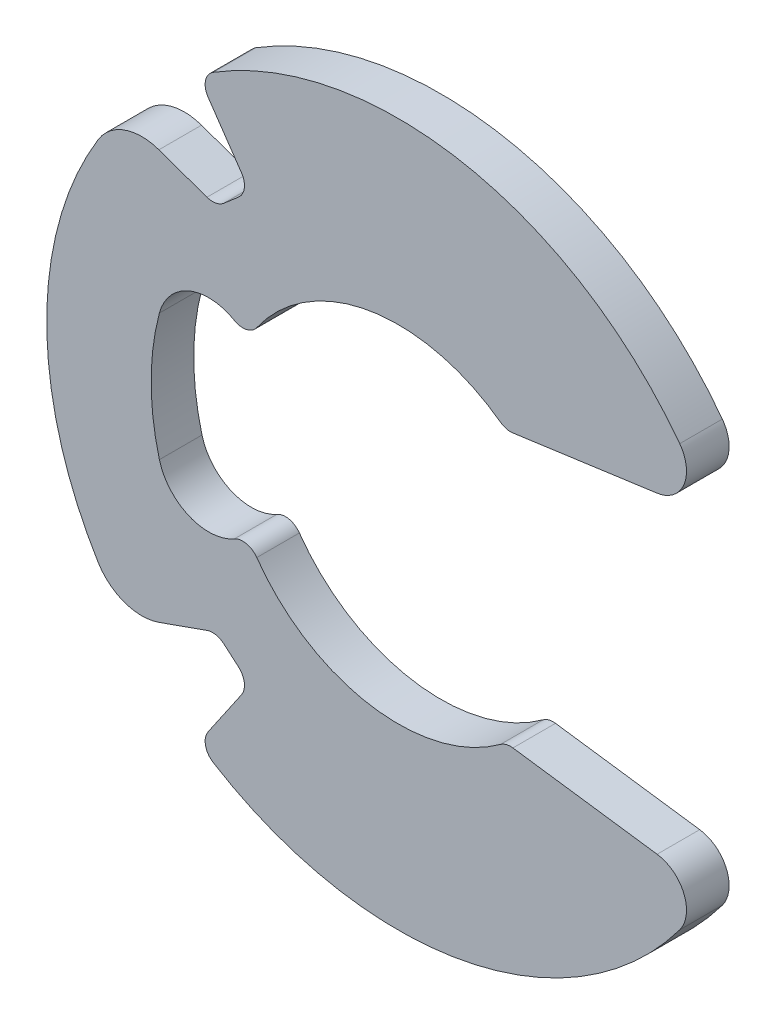
ISO-10303-21;
HEADER;
FILE_DESCRIPTION(('STEP AP214'),'2;1');
FILE_NAME('part.step','',(''),(''),'','','');
FILE_SCHEMA(('AUTOMOTIVE_DESIGN { 1 0 10303 214 1 1 1 1 }'));
ENDSEC;
DATA;
#1=APPLICATION_CONTEXT('core data for automotive mechanical design processes');
#2=APPLICATION_PROTOCOL_DEFINITION('international standard','automotive_design',2000,#1);
#3=PRODUCT_CONTEXT('',#1,'mechanical');
#4=PRODUCT('Part','Part','',(#3));
#5=PRODUCT_RELATED_PRODUCT_CATEGORY('part','',(#4));
#6=PRODUCT_DEFINITION_FORMATION('','',#4);
#7=PRODUCT_DEFINITION_CONTEXT('part definition',#1,'design');
#8=PRODUCT_DEFINITION('design','',#6,#7);
#9=PRODUCT_DEFINITION_SHAPE('','',#8);
#10=(LENGTH_UNIT() NAMED_UNIT(*) SI_UNIT(.MILLI.,.METRE.));
#11=(NAMED_UNIT(*) PLANE_ANGLE_UNIT() SI_UNIT($,.RADIAN.));
#12=(NAMED_UNIT(*) SI_UNIT($,.STERADIAN.) SOLID_ANGLE_UNIT());
#13=UNCERTAINTY_MEASURE_WITH_UNIT(LENGTH_MEASURE(1.E-05),#10,'distance_accuracy_value','');
#14=(GEOMETRIC_REPRESENTATION_CONTEXT(3) GLOBAL_UNCERTAINTY_ASSIGNED_CONTEXT((#13)) GLOBAL_UNIT_ASSIGNED_CONTEXT((#10,
#11,#12)) REPRESENTATION_CONTEXT('',''));
#15=CARTESIAN_POINT('',(0.,0.,0.));
#16=DIRECTION('',(0.,0.,1.));
#17=DIRECTION('',(1.,0.,0.));
#18=AXIS2_PLACEMENT_3D('',#15,#16,#17);
#19=CARTESIAN_POINT('',(0.,0.,0.));
#20=DIRECTION('',(0.,0.,-1.));
#21=DIRECTION('',(-1.,0.,0.));
#22=AXIS2_PLACEMENT_3D('',#19,#20,#21);
#23=PLANE('',#22);
#24=CARTESIAN_POINT('',(0.,0.,0.));
#25=DIRECTION('',(0.,0.,-1.));
#26=DIRECTION('',(-1.,0.,0.));
#27=AXIS2_PLACEMENT_3D('',#24,#25,#26);
#28=CIRCLE('',#27,5.1562);
#29=CARTESIAN_POINT('',(-4.21618561440545,-2.96819428354689,0.));
#30=VERTEX_POINT('',#29);
#31=CARTESIAN_POINT('',(3.04826151729699,-4.15866567088125,0.));
#32=VERTEX_POINT('',#31);
#33=EDGE_CURVE('E339',#30,#32,#28,.F.);
#34=ORIENTED_EDGE('',*,*,#33,.T.);
#35=CARTESIAN_POINT('',(3.34858284905039,-4.5683864266331,0.));
#36=DIRECTION('',(0.,0.,-1.));
#37=DIRECTION('',(-1.,0.,0.));
#38=AXIS2_PLACEMENT_3D('',#35,#36,#37);
#39=CIRCLE('',#38,0.508);
#40=CARTESIAN_POINT('',(3.41825205926127,-4.06518646523744,0.));
#41=VERTEX_POINT('',#40);
#42=EDGE_CURVE('E336',#41,#32,#39,.F.);
#43=ORIENTED_EDGE('',*,*,#42,.F.);
#44=DIRECTION('',(0.990551105109562,-0.137144114588364,0.));
#45=VECTOR('',#44,1.);
#46=CARTESIAN_POINT('',(0.,-3.59192148204873,0.));
#47=LINE('',#46,#45);
#48=CARTESIAN_POINT('',(7.71621548730133,-4.66024954258016,0.));
#49=VERTEX_POINT('',#48);
#50=EDGE_CURVE('E235',#41,#49,#47,.T.);
#51=ORIENTED_EDGE('',*,*,#50,.T.);
#52=CARTESIAN_POINT('',(7.57687706687955,-5.66664946537147,0.));
#53=DIRECTION('',(0.,0.,-1.));
#54=DIRECTION('',(-1.,0.,0.));
#55=AXIS2_PLACEMENT_3D('',#52,#53,#54);
#56=CIRCLE('',#55,1.016);
#57=CARTESIAN_POINT('',(8.39050144990017,-6.27514873682076,0.));
#58=VERTEX_POINT('',#57);
#59=EDGE_CURVE('E238',#58,#49,#56,.F.);
#60=ORIENTED_EDGE('',*,*,#59,.F.);
#61=CARTESIAN_POINT('',(0.,0.,0.));
#62=DIRECTION('',(0.,0.,-1.));
#63=DIRECTION('',(-1.,0.,0.));
#64=AXIS2_PLACEMENT_3D('',#61,#62,#63);
#65=CIRCLE('',#64,10.4775);
#66=CARTESIAN_POINT('',(-5.51465485817055,-8.90879273780998,0.));
#67=VERTEX_POINT('',#66);
#68=EDGE_CURVE('E215',#67,#58,#65,.F.);
#69=ORIENTED_EDGE('',*,*,#68,.F.);
#70=CARTESIAN_POINT('',(-5.24727765292592,-8.47685127173434,0.));
#71=DIRECTION('',(0.,0.,-1.));
#72=DIRECTION('',(-1.,0.,0.));
#73=AXIS2_PLACEMENT_3D('',#70,#71,#72);
#74=CIRCLE('',#73,0.508);
#75=CARTESIAN_POINT('',(-5.6664647231543,-8.18989099547062,0.));
#76=VERTEX_POINT('',#75);
#77=EDGE_CURVE('E20',#76,#67,#74,.F.);
#78=ORIENTED_EDGE('',*,*,#77,.F.);
#79=DIRECTION('',(0.56488243359,0.825171398087354,0.));
#80=VECTOR('',#79,1.);
#81=CARTESIAN_POINT('',(-7.96096866359448,-11.541666359447,0.));
#82=LINE('',#81,#80);
#83=CARTESIAN_POINT('',(-4.67174469224146,-6.73681957776461,0.));
#84=VERTEX_POINT('',#83);
#85=EDGE_CURVE('E212',#76,#84,#82,.T.);
#86=ORIENTED_EDGE('',*,*,#85,.T.);
#87=CARTESIAN_POINT('',(-5.09093176246983,-6.4498593015009,0.));
#88=DIRECTION('',(0.,0.,-1.));
#89=DIRECTION('',(-1.,0.,0.));
#90=AXIS2_PLACEMENT_3D('',#87,#88,#89);
#91=CIRCLE('',#90,0.508);
#92=CARTESIAN_POINT('',(-4.75923843445855,-6.0650950410078,0.));
#93=VERTEX_POINT('',#92);
#94=EDGE_CURVE('E387',#84,#93,#91,.F.);
#95=ORIENTED_EDGE('',*,*,#94,.T.);
#96=DIRECTION('',(-0.757409961600578,0.652939622069462,0.));
#97=VECTOR('',#96,1.);
#98=CARTESIAN_POINT('',(-4.41503502304148,-6.36182211981562,0.));
#99=LINE('',#98,#97);
#100=CARTESIAN_POINT('',(-5.19974545035899,-5.68534761350743,0.));
#101=VERTEX_POINT('',#100);
#102=EDGE_CURVE('E262',#93,#101,#99,.T.);
#103=ORIENTED_EDGE('',*,*,#102,.T.);
#104=CARTESIAN_POINT('',(-5.53143877837027,-6.07011187400052,0.));
#105=DIRECTION('',(0.,0.,-1.));
#106=DIRECTION('',(-1.,0.,0.));
#107=AXIS2_PLACEMENT_3D('',#104,#105,#106);
#108=CIRCLE('',#107,0.508);
#109=CARTESIAN_POINT('',(-5.70123922502142,-5.59133028672186,0.));
#110=VERTEX_POINT('',#109);
#111=EDGE_CURVE('E386',#101,#110,#108,.F.);
#112=ORIENTED_EDGE('',*,*,#111,.T.);
#113=DIRECTION('',(-0.942483439524914,-0.334252847738487,0.));
#114=VECTOR('',#113,1.);
#115=CARTESIAN_POINT('',(-5.42319262672811,-5.49272073732714,0.));
#116=LINE('',#115,#114);
#117=CARTESIAN_POINT('',(-7.13394241485243,-6.09944013892937,0.));
#118=VERTEX_POINT('',#117);
#119=EDGE_CURVE('E257',#110,#118,#116,.T.);
#120=ORIENTED_EDGE('',*,*,#119,.T.);
#121=CARTESIAN_POINT('',(-7.64334375480588,-4.6630953770934,0.));
#122=DIRECTION('',(0.,0.,-1.));
#123=DIRECTION('',(-1.,0.,0.));
#124=AXIS2_PLACEMENT_3D('',#121,#122,#123);
#125=CIRCLE('',#124,1.524);
#126=CARTESIAN_POINT('',(-8.94433843647497,-5.45681373915185,0.));
#127=VERTEX_POINT('',#126);
#128=EDGE_CURVE('E260',#127,#118,#125,.F.);
#129=ORIENTED_EDGE('',*,*,#128,.F.);
#130=CARTESIAN_POINT('',(0.,0.,0.));
#131=DIRECTION('',(0.,0.,-1.));
#132=DIRECTION('',(-1.,0.,0.));
#133=AXIS2_PLACEMENT_3D('',#130,#131,#132);
#134=CIRCLE('',#133,10.4775);
#135=CARTESIAN_POINT('',(-8.94433843647498,5.45681373915185,0.));
#136=VERTEX_POINT('',#135);
#137=EDGE_CURVE('E381',#136,#127,#134,.F.);
#138=ORIENTED_EDGE('',*,*,#137,.F.);
#139=CARTESIAN_POINT('',(-7.64334375480589,4.6630953770934,0.));
#140=DIRECTION('',(0.,0.,-1.));
#141=DIRECTION('',(-1.,0.,0.));
#142=AXIS2_PLACEMENT_3D('',#139,#140,#141);
#143=CIRCLE('',#142,1.524);
#144=CARTESIAN_POINT('',(-7.13394241485244,6.09944013892937,0.));
#145=VERTEX_POINT('',#144);
#146=EDGE_CURVE('E379',#145,#136,#143,.F.);
#147=ORIENTED_EDGE('',*,*,#146,.F.);
#148=DIRECTION('',(-0.942483439524914,0.334252847738487,0.));
#149=VECTOR('',#148,1.);
#150=CARTESIAN_POINT('',(-5.42319262672811,5.49272073732714,0.));
#151=LINE('',#150,#149);
#152=CARTESIAN_POINT('',(-5.70123922502142,5.59133028672186,0.));
#153=VERTEX_POINT('',#152);
#154=EDGE_CURVE('E253',#153,#145,#151,.T.);
#155=ORIENTED_EDGE('',*,*,#154,.F.);
#156=CARTESIAN_POINT('',(-5.53143877837027,6.07011187400052,0.));
#157=DIRECTION('',(0.,0.,-1.));
#158=DIRECTION('',(-1.,0.,0.));
#159=AXIS2_PLACEMENT_3D('',#156,#157,#158);
#160=CIRCLE('',#159,0.508);
#161=CARTESIAN_POINT('',(-5.19974545035898,5.68534761350743,0.));
#162=VERTEX_POINT('',#161);
#163=EDGE_CURVE('E252',#153,#162,#160,.F.);
#164=ORIENTED_EDGE('',*,*,#163,.T.);
#165=DIRECTION('',(-0.757409961600578,-0.652939622069462,0.));
#166=VECTOR('',#165,1.);
#167=CARTESIAN_POINT('',(-4.41503502304148,6.36182211981562,0.));
#168=LINE('',#167,#166);
#169=CARTESIAN_POINT('',(-4.75923843445855,6.0650950410078,0.));
#170=VERTEX_POINT('',#169);
#171=EDGE_CURVE('E249',#170,#162,#168,.T.);
#172=ORIENTED_EDGE('',*,*,#171,.F.);
#173=CARTESIAN_POINT('',(-5.09093176246983,6.4498593015009,0.));
#174=DIRECTION('',(0.,0.,-1.));
#175=DIRECTION('',(-1.,0.,0.));
#176=AXIS2_PLACEMENT_3D('',#173,#174,#175);
#177=CIRCLE('',#176,0.508);
#178=CARTESIAN_POINT('',(-4.67174469224146,6.73681957776462,0.));
#179=VERTEX_POINT('',#178);
#180=EDGE_CURVE('E248',#170,#179,#177,.F.);
#181=ORIENTED_EDGE('',*,*,#180,.T.);
#182=DIRECTION('',(0.564882433590001,-0.825171398087354,0.));
#183=VECTOR('',#182,1.);
#184=CARTESIAN_POINT('',(-7.96096866359448,11.541666359447,0.));
#185=LINE('',#184,#183);
#186=CARTESIAN_POINT('',(-5.6664647231543,8.18989099547063,0.));
#187=VERTEX_POINT('',#186);
#188=EDGE_CURVE('E245',#187,#179,#185,.T.);
#189=ORIENTED_EDGE('',*,*,#188,.F.);
#190=CARTESIAN_POINT('',(-5.24727765292593,8.47685127173435,0.));
#191=DIRECTION('',(0.,0.,-1.));
#192=DIRECTION('',(-1.,0.,0.));
#193=AXIS2_PLACEMENT_3D('',#190,#191,#192);
#194=CIRCLE('',#193,0.508);
#195=CARTESIAN_POINT('',(-5.51465485817056,8.90879273780999,0.));
#196=VERTEX_POINT('',#195);
#197=EDGE_CURVE('E370',#196,#187,#194,.F.);
#198=ORIENTED_EDGE('',*,*,#197,.F.);
#199=CARTESIAN_POINT('',(0.,0.,0.));
#200=DIRECTION('',(0.,0.,-1.));
#201=DIRECTION('',(-1.,0.,0.));
#202=AXIS2_PLACEMENT_3D('',#199,#200,#201);
#203=CIRCLE('',#202,10.4775);
#204=CARTESIAN_POINT('',(8.39050144990018,6.27514873682076,0.));
#205=VERTEX_POINT('',#204);
#206=EDGE_CURVE('E368',#205,#196,#203,.F.);
#207=ORIENTED_EDGE('',*,*,#206,.F.);
#208=CARTESIAN_POINT('',(7.57687706687956,5.66664946537147,0.));
#209=DIRECTION('',(0.,0.,-1.));
#210=DIRECTION('',(-1.,0.,0.));
#211=AXIS2_PLACEMENT_3D('',#208,#209,#210);
#212=CIRCLE('',#211,1.016);
#213=CARTESIAN_POINT('',(7.71621548730134,4.66024954258016,0.));
#214=VERTEX_POINT('',#213);
#215=EDGE_CURVE('E364',#214,#205,#212,.F.);
#216=ORIENTED_EDGE('',*,*,#215,.F.);
#217=DIRECTION('',(-0.990551105109562,-0.137144114588364,0.));
#218=VECTOR('',#217,1.);
#219=CARTESIAN_POINT('',(11.2983179723503,5.15619999999999,0.));
#220=LINE('',#219,#218);
#221=CARTESIAN_POINT('',(3.41825205926129,4.06518646523745,0.));
#222=VERTEX_POINT('',#221);
#223=EDGE_CURVE('E240',#214,#222,#220,.T.);
#224=ORIENTED_EDGE('',*,*,#223,.T.);
#225=CARTESIAN_POINT('',(3.3485828490504,4.5683864266331,0.));
#226=DIRECTION('',(0.,0.,-1.));
#227=DIRECTION('',(-1.,0.,0.));
#228=AXIS2_PLACEMENT_3D('',#225,#226,#227);
#229=CIRCLE('',#228,0.508);
#230=CARTESIAN_POINT('',(3.048261517297,4.15866567088126,0.));
#231=VERTEX_POINT('',#230);
#232=EDGE_CURVE('E243',#231,#222,#229,.F.);
#233=ORIENTED_EDGE('',*,*,#232,.F.);
#234=CARTESIAN_POINT('',(0.,0.,0.));
#235=DIRECTION('',(0.,0.,-1.));
#236=DIRECTION('',(-1.,0.,0.));
#237=AXIS2_PLACEMENT_3D('',#234,#235,#236);
#238=CIRCLE('',#237,5.1562);
#239=CARTESIAN_POINT('',(-4.21618561440546,2.96819428354689,0.));
#240=VERTEX_POINT('',#239);
#241=EDGE_CURVE('E358',#231,#240,#238,.F.);
#242=ORIENTED_EDGE('',*,*,#241,.T.);
#243=CARTESIAN_POINT('',(-4.63157335966708,3.26062721788649,0.));
#244=DIRECTION('',(0.,0.,1.));
#245=DIRECTION('',(1.,0.,0.));
#246=AXIS2_PLACEMENT_3D('',#243,#244,#245);
#247=CIRCLE('',#246,0.508);
#248=CARTESIAN_POINT('',(-4.88521418696268,2.82047913970279,0.));
#249=VERTEX_POINT('',#248);
#250=EDGE_CURVE('E355',#249,#240,#247,.T.);
#251=ORIENTED_EDGE('',*,*,#250,.F.);
#252=CARTESIAN_POINT('',(-5.64613666884947,1.50003490515168,0.));
#253=DIRECTION('',(0.,0.,1.));
#254=DIRECTION('',(1.,0.,0.));
#255=AXIS2_PLACEMENT_3D('',#252,#253,#254);
#256=CIRCLE('',#255,1.524);
#257=CARTESIAN_POINT('',(-7.1190418868102,1.89134835866951,0.));
#258=VERTEX_POINT('',#257);
#259=EDGE_CURVE('E352',#249,#258,#256,.T.);
#260=ORIENTED_EDGE('',*,*,#259,.T.);
#261=CARTESIAN_POINT('',(0.,0.,0.));
#262=DIRECTION('',(0.,0.,1.));
#263=DIRECTION('',(1.,0.,0.));
#264=AXIS2_PLACEMENT_3D('',#261,#262,#263);
#265=CIRCLE('',#264,7.366);
#266=CARTESIAN_POINT('',(-7.11904188681019,-1.89134835866951,0.));
#267=VERTEX_POINT('',#266);
#268=EDGE_CURVE('E349',#258,#267,#265,.T.);
#269=ORIENTED_EDGE('',*,*,#268,.T.);
#270=CARTESIAN_POINT('',(-5.64613666884946,-1.50003490515168,0.));
#271=DIRECTION('',(0.,0.,1.));
#272=DIRECTION('',(1.,0.,0.));
#273=AXIS2_PLACEMENT_3D('',#270,#271,#272);
#274=CIRCLE('',#273,1.524);
#275=CARTESIAN_POINT('',(-4.88521418696267,-2.82047913970278,0.));
#276=VERTEX_POINT('',#275);
#277=EDGE_CURVE('E345',#267,#276,#274,.T.);
#278=ORIENTED_EDGE('',*,*,#277,.T.);
#279=CARTESIAN_POINT('',(-4.63157335966708,-3.26062721788648,0.));
#280=DIRECTION('',(0.,0.,-1.));
#281=DIRECTION('',(-1.,0.,0.));
#282=AXIS2_PLACEMENT_3D('',#279,#280,#281);
#283=CIRCLE('',#282,0.508);
#284=EDGE_CURVE('E342',#30,#276,#283,.F.);
#285=ORIENTED_EDGE('',*,*,#284,.F.);
#286=EDGE_LOOP('',(#34,#43,#51,#60,#69,#78,#86,#95,#103,#112,#120,#129,#138,#147,#155,#164,#172,
#181,#189,#198,#207,#216,#224,#233,#242,#251,#260,#269,#278,#285));
#287=FACE_BOUND('',#286,.T.);
#288=ADVANCED_FACE('F17',(#287),#23,.T.);
#289=CARTESIAN_POINT('',(-5.24727765292592,-8.47685127173434,1.27));
#290=DIRECTION('',(0.,0.,-1.));
#291=DIRECTION('',(-1.,0.,0.));
#292=AXIS2_PLACEMENT_3D('',#289,#290,#291);
#293=CYLINDRICAL_SURFACE('',#292,0.508);
#294=DIRECTION('',(0.,0.,1.));
#295=VECTOR('',#294,1.);
#296=CARTESIAN_POINT('',(-5.6664647231543,-8.18989099547062,-28.9619533727259));
#297=LINE('',#296,#295);
#298=CARTESIAN_POINT('',(-5.66646472315429,-8.18989099547062,1.27));
#299=VERTEX_POINT('',#298);
#300=EDGE_CURVE('E220',#299,#76,#297,.F.);
#301=ORIENTED_EDGE('',*,*,#300,.T.);
#302=ORIENTED_EDGE('',*,*,#77,.T.);
#303=DIRECTION('',(0.,0.,-1.));
#304=VECTOR('',#303,1.);
#305=CARTESIAN_POINT('',(-5.51465485817055,-8.90879273780998,1.27));
#306=LINE('',#305,#304);
#307=CARTESIAN_POINT('',(-5.51465485817055,-8.90879273780998,1.27));
#308=VERTEX_POINT('',#307);
#309=EDGE_CURVE('E332',#308,#67,#306,.T.);
#310=ORIENTED_EDGE('',*,*,#309,.F.);
#311=CARTESIAN_POINT('',(-5.24727765292592,-8.47685127173434,1.27));
#312=DIRECTION('',(0.,0.,-1.));
#313=DIRECTION('',(-1.,0.,0.));
#314=AXIS2_PLACEMENT_3D('',#311,#312,#313);
#315=CIRCLE('',#314,0.508);
#316=EDGE_CURVE('E230',#308,#299,#315,.T.);
#317=ORIENTED_EDGE('',*,*,#316,.T.);
#318=EDGE_LOOP('',(#301,#302,#310,#317));
#319=FACE_BOUND('',#318,.T.);
#320=ADVANCED_FACE('F229',(#319),#293,.T.);
#321=CARTESIAN_POINT('',(-7.96096866359448,-11.541666359447,-28.9619533727259));
#322=DIRECTION('',(0.825171398087354,-0.56488243359,0.));
#323=DIRECTION('',(0.56488243359,0.825171398087354,0.));
#324=AXIS2_PLACEMENT_3D('',#321,#322,#323);
#325=PLANE('',#324);
#326=ORIENTED_EDGE('',*,*,#300,.F.);
#327=DIRECTION('',(0.56488243359,0.825171398087354,0.));
#328=VECTOR('',#327,1.);
#329=CARTESIAN_POINT('',(-5.66646472315429,-8.18989099547062,1.27));
#330=LINE('',#329,#328);
#331=CARTESIAN_POINT('',(-4.67174469224146,-6.73681957776462,1.27));
#332=VERTEX_POINT('',#331);
#333=EDGE_CURVE('E330',#299,#332,#330,.T.);
#334=ORIENTED_EDGE('',*,*,#333,.T.);
#335=DIRECTION('',(0.,0.,-1.));
#336=VECTOR('',#335,1.);
#337=CARTESIAN_POINT('',(-4.67174469224146,-6.73681957776461,-28.9619533727259));
#338=LINE('',#337,#336);
#339=EDGE_CURVE('E227',#332,#84,#338,.T.);
#340=ORIENTED_EDGE('',*,*,#339,.T.);
#341=ORIENTED_EDGE('',*,*,#85,.F.);
#342=EDGE_LOOP('',(#326,#334,#340,#341));
#343=FACE_BOUND('',#342,.T.);
#344=ADVANCED_FACE('F224',(#343),#325,.F.);
#345=CARTESIAN_POINT('',(-5.09093176246983,-6.4498593015009,-28.9619533727259));
#346=DIRECTION('',(0.,0.,-1.));
#347=DIRECTION('',(-1.,0.,0.));
#348=AXIS2_PLACEMENT_3D('',#345,#346,#347);
#349=CYLINDRICAL_SURFACE('',#348,0.508);
#350=ORIENTED_EDGE('',*,*,#339,.F.);
#351=CARTESIAN_POINT('',(-5.09093176246983,-6.4498593015009,1.27));
#352=DIRECTION('',(0.,0.,-1.));
#353=DIRECTION('',(-1.,0.,0.));
#354=AXIS2_PLACEMENT_3D('',#351,#352,#353);
#355=CIRCLE('',#354,0.508);
#356=CARTESIAN_POINT('',(-4.75923843445855,-6.0650950410078,1.27));
#357=VERTEX_POINT('',#356);
#358=EDGE_CURVE('E327',#332,#357,#355,.F.);
#359=ORIENTED_EDGE('',*,*,#358,.T.);
#360=DIRECTION('',(0.,0.,1.));
#361=VECTOR('',#360,1.);
#362=CARTESIAN_POINT('',(-4.75923843445855,-6.0650950410078,-28.9619533727259));
#363=LINE('',#362,#361);
#364=EDGE_CURVE('E264',#357,#93,#363,.F.);
#365=ORIENTED_EDGE('',*,*,#364,.T.);
#366=ORIENTED_EDGE('',*,*,#94,.F.);
#367=EDGE_LOOP('',(#350,#359,#365,#366));
#368=FACE_BOUND('',#367,.T.);
#369=ADVANCED_FACE('F554',(#368),#349,.F.);
#370=CARTESIAN_POINT('',(-4.41503502304148,-6.36182211981562,-28.9619533727259));
#371=DIRECTION('',(0.652939622069462,0.757409961600578,0.));
#372=DIRECTION('',(-0.757409961600578,0.652939622069462,0.));
#373=AXIS2_PLACEMENT_3D('',#370,#371,#372);
#374=PLANE('',#373);
#375=ORIENTED_EDGE('',*,*,#364,.F.);
#376=DIRECTION('',(-0.757409961600577,0.652939622069462,0.));
#377=VECTOR('',#376,1.);
#378=CARTESIAN_POINT('',(-4.75923843445855,-6.0650950410078,1.27));
#379=LINE('',#378,#377);
#380=CARTESIAN_POINT('',(-5.19974545035899,-5.68534761350743,1.27));
#381=VERTEX_POINT('',#380);
#382=EDGE_CURVE('E326',#357,#381,#379,.T.);
#383=ORIENTED_EDGE('',*,*,#382,.T.);
#384=DIRECTION('',(0.,0.,-1.));
#385=VECTOR('',#384,1.);
#386=CARTESIAN_POINT('',(-5.19974545035899,-5.68534761350743,-28.9619533727259));
#387=LINE('',#386,#385);
#388=EDGE_CURVE('E263',#381,#101,#387,.T.);
#389=ORIENTED_EDGE('',*,*,#388,.T.);
#390=ORIENTED_EDGE('',*,*,#102,.F.);
#391=EDGE_LOOP('',(#375,#383,#389,#390));
#392=FACE_BOUND('',#391,.T.);
#393=ADVANCED_FACE('F552',(#392),#374,.F.);
#394=CARTESIAN_POINT('',(-5.53143877837027,-6.07011187400052,-28.9619533727259));
#395=DIRECTION('',(0.,0.,-1.));
#396=DIRECTION('',(-1.,0.,0.));
#397=AXIS2_PLACEMENT_3D('',#394,#395,#396);
#398=CYLINDRICAL_SURFACE('',#397,0.508);
#399=ORIENTED_EDGE('',*,*,#388,.F.);
#400=CARTESIAN_POINT('',(-5.53143877837027,-6.07011187400052,1.27));
#401=DIRECTION('',(0.,0.,-1.));
#402=DIRECTION('',(-1.,0.,0.));
#403=AXIS2_PLACEMENT_3D('',#400,#401,#402);
#404=CIRCLE('',#403,0.508);
#405=CARTESIAN_POINT('',(-5.70123922502142,-5.59133028672186,1.27));
#406=VERTEX_POINT('',#405);
#407=EDGE_CURVE('E323',#381,#406,#404,.F.);
#408=ORIENTED_EDGE('',*,*,#407,.T.);
#409=DIRECTION('',(0.,0.,1.));
#410=VECTOR('',#409,1.);
#411=CARTESIAN_POINT('',(-5.70123922502142,-5.59133028672186,-28.9619533727259));
#412=LINE('',#411,#410);
#413=EDGE_CURVE('E261',#406,#110,#412,.F.);
#414=ORIENTED_EDGE('',*,*,#413,.T.);
#415=ORIENTED_EDGE('',*,*,#111,.F.);
#416=EDGE_LOOP('',(#399,#408,#414,#415));
#417=FACE_BOUND('',#416,.T.);
#418=ADVANCED_FACE('F549',(#417),#398,.F.);
#419=CARTESIAN_POINT('',(-5.42319262672811,-5.49272073732714,-28.9619533727259));
#420=DIRECTION('',(-0.334252847738487,0.942483439524914,0.));
#421=DIRECTION('',(-0.942483439524914,-0.334252847738487,0.));
#422=AXIS2_PLACEMENT_3D('',#419,#420,#421);
#423=PLANE('',#422);
#424=ORIENTED_EDGE('',*,*,#413,.F.);
#425=DIRECTION('',(-0.942483439524914,-0.334252847738487,0.));
#426=VECTOR('',#425,1.);
#427=CARTESIAN_POINT('',(-5.70123922502142,-5.59133028672186,1.27));
#428=LINE('',#427,#426);
#429=CARTESIAN_POINT('',(-7.13394241485243,-6.09944013892937,1.27));
#430=VERTEX_POINT('',#429);
#431=EDGE_CURVE('E322',#406,#430,#428,.T.);
#432=ORIENTED_EDGE('',*,*,#431,.T.);
#433=DIRECTION('',(0.,0.,-1.));
#434=VECTOR('',#433,1.);
#435=CARTESIAN_POINT('',(-7.13394241485242,-6.09944013892937,1.27));
#436=LINE('',#435,#434);
#437=EDGE_CURVE('E385',#118,#430,#436,.F.);
#438=ORIENTED_EDGE('',*,*,#437,.F.);
#439=ORIENTED_EDGE('',*,*,#119,.F.);
#440=EDGE_LOOP('',(#424,#432,#438,#439));
#441=FACE_BOUND('',#440,.T.);
#442=ADVANCED_FACE('F545',(#441),#423,.F.);
#443=CARTESIAN_POINT('',(-7.64334375480588,-4.6630953770934,1.27));
#444=DIRECTION('',(0.,0.,-1.));
#445=DIRECTION('',(-1.,0.,0.));
#446=AXIS2_PLACEMENT_3D('',#443,#444,#445);
#447=CYLINDRICAL_SURFACE('',#446,1.524);
#448=ORIENTED_EDGE('',*,*,#128,.T.);
#449=ORIENTED_EDGE('',*,*,#437,.T.);
#450=CARTESIAN_POINT('',(-7.64334375480588,-4.6630953770934,1.27));
#451=DIRECTION('',(0.,0.,-1.));
#452=DIRECTION('',(-1.,0.,0.));
#453=AXIS2_PLACEMENT_3D('',#450,#451,#452);
#454=CIRCLE('',#453,1.524);
#455=CARTESIAN_POINT('',(-8.94433843647497,-5.45681373915185,1.27));
#456=VERTEX_POINT('',#455);
#457=EDGE_CURVE('E319',#430,#456,#454,.T.);
#458=ORIENTED_EDGE('',*,*,#457,.T.);
#459=DIRECTION('',(0.,0.,-1.));
#460=VECTOR('',#459,1.);
#461=CARTESIAN_POINT('',(-8.94433843647497,-5.45681373915185,1.27));
#462=LINE('',#461,#460);
#463=EDGE_CURVE('E383',#127,#456,#462,.F.);
#464=ORIENTED_EDGE('',*,*,#463,.F.);
#465=EDGE_LOOP('',(#448,#449,#458,#464));
#466=FACE_BOUND('',#465,.T.);
#467=ADVANCED_FACE('F540',(#466),#447,.T.);
#468=CARTESIAN_POINT('',(0.,0.,1.27));
#469=DIRECTION('',(0.,0.,-1.));
#470=DIRECTION('',(-1.,0.,0.));
#471=AXIS2_PLACEMENT_3D('',#468,#469,#470);
#472=CYLINDRICAL_SURFACE('',#471,10.4775);
#473=DIRECTION('',(0.,0.,-1.));
#474=VECTOR('',#473,1.);
#475=CARTESIAN_POINT('',(-8.94433843647498,5.45681373915185,1.27));
#476=LINE('',#475,#474);
#477=CARTESIAN_POINT('',(-8.94433843647498,5.45681373915185,1.27));
#478=VERTEX_POINT('',#477);
#479=EDGE_CURVE('E256',#136,#478,#476,.F.);
#480=ORIENTED_EDGE('',*,*,#479,.F.);
#481=ORIENTED_EDGE('',*,*,#137,.T.);
#482=ORIENTED_EDGE('',*,*,#463,.T.);
#483=CARTESIAN_POINT('',(0.,0.,1.27));
#484=DIRECTION('',(0.,0.,-1.));
#485=DIRECTION('',(-1.,0.,0.));
#486=AXIS2_PLACEMENT_3D('',#483,#484,#485);
#487=CIRCLE('',#486,10.4775);
#488=EDGE_CURVE('E317',#456,#478,#487,.T.);
#489=ORIENTED_EDGE('',*,*,#488,.T.);
#490=EDGE_LOOP('',(#480,#481,#482,#489));
#491=FACE_BOUND('',#490,.T.);
#492=ADVANCED_FACE('F617',(#491),#472,.T.);
#493=CARTESIAN_POINT('',(-7.64334375480589,4.6630953770934,1.27));
#494=DIRECTION('',(0.,0.,-1.));
#495=DIRECTION('',(-1.,0.,0.));
#496=AXIS2_PLACEMENT_3D('',#493,#494,#495);
#497=CYLINDRICAL_SURFACE('',#496,1.524);
#498=ORIENTED_EDGE('',*,*,#146,.T.);
#499=ORIENTED_EDGE('',*,*,#479,.T.);
#500=CARTESIAN_POINT('',(-7.64334375480589,4.6630953770934,1.27));
#501=DIRECTION('',(0.,0.,-1.));
#502=DIRECTION('',(-1.,0.,0.));
#503=AXIS2_PLACEMENT_3D('',#500,#501,#502);
#504=CIRCLE('',#503,1.524);
#505=CARTESIAN_POINT('',(-7.13394241485243,6.09944013892937,1.27));
#506=VERTEX_POINT('',#505);
#507=EDGE_CURVE('E314',#478,#506,#504,.T.);
#508=ORIENTED_EDGE('',*,*,#507,.T.);
#509=DIRECTION('',(0.,0.,1.));
#510=VECTOR('',#509,1.);
#511=CARTESIAN_POINT('',(-7.13394241485244,6.09944013892937,-28.9619533727259));
#512=LINE('',#511,#510);
#513=EDGE_CURVE('E255',#145,#506,#512,.T.);
#514=ORIENTED_EDGE('',*,*,#513,.F.);
#515=EDGE_LOOP('',(#498,#499,#508,#514));
#516=FACE_BOUND('',#515,.T.);
#517=ADVANCED_FACE('F531',(#516),#497,.T.);
#518=CARTESIAN_POINT('',(-5.42319262672811,5.49272073732714,-28.9619533727259));
#519=DIRECTION('',(0.334252847738487,0.942483439524914,0.));
#520=DIRECTION('',(-0.942483439524914,0.334252847738487,0.));
#521=AXIS2_PLACEMENT_3D('',#518,#519,#520);
#522=PLANE('',#521);
#523=ORIENTED_EDGE('',*,*,#154,.T.);
#524=ORIENTED_EDGE('',*,*,#513,.T.);
#525=DIRECTION('',(0.942483439524914,-0.334252847738487,0.));
#526=VECTOR('',#525,1.);
#527=CARTESIAN_POINT('',(-7.13394241485243,6.09944013892937,1.27));
#528=LINE('',#527,#526);
#529=CARTESIAN_POINT('',(-5.70123922502142,5.59133028672186,1.27));
#530=VERTEX_POINT('',#529);
#531=EDGE_CURVE('E313',#506,#530,#528,.T.);
#532=ORIENTED_EDGE('',*,*,#531,.T.);
#533=DIRECTION('',(0.,0.,-1.));
#534=VECTOR('',#533,1.);
#535=CARTESIAN_POINT('',(-5.70123922502142,5.59133028672186,-28.9619533727259));
#536=LINE('',#535,#534);
#537=EDGE_CURVE('E378',#530,#153,#536,.T.);
#538=ORIENTED_EDGE('',*,*,#537,.T.);
#539=EDGE_LOOP('',(#523,#524,#532,#538));
#540=FACE_BOUND('',#539,.T.);
#541=ADVANCED_FACE('F527',(#540),#522,.T.);
#542=CARTESIAN_POINT('',(-5.53143877837027,6.07011187400052,-28.9619533727259));
#543=DIRECTION('',(0.,0.,-1.));
#544=DIRECTION('',(-1.,0.,0.));
#545=AXIS2_PLACEMENT_3D('',#542,#543,#544);
#546=CYLINDRICAL_SURFACE('',#545,0.508);
#547=ORIENTED_EDGE('',*,*,#537,.F.);
#548=CARTESIAN_POINT('',(-5.53143877837027,6.07011187400052,1.27));
#549=DIRECTION('',(0.,0.,-1.));
#550=DIRECTION('',(-1.,0.,0.));
#551=AXIS2_PLACEMENT_3D('',#548,#549,#550);
#552=CIRCLE('',#551,0.508);
#553=CARTESIAN_POINT('',(-5.19974545035898,5.68534761350743,1.27));
#554=VERTEX_POINT('',#553);
#555=EDGE_CURVE('E310',#530,#554,#552,.F.);
#556=ORIENTED_EDGE('',*,*,#555,.T.);
#557=DIRECTION('',(0.,0.,1.));
#558=VECTOR('',#557,1.);
#559=CARTESIAN_POINT('',(-5.19974545035898,5.68534761350743,-28.9619533727259));
#560=LINE('',#559,#558);
#561=EDGE_CURVE('E251',#162,#554,#560,.T.);
#562=ORIENTED_EDGE('',*,*,#561,.F.);
#563=ORIENTED_EDGE('',*,*,#163,.F.);
#564=EDGE_LOOP('',(#547,#556,#562,#563));
#565=FACE_BOUND('',#564,.T.);
#566=ADVANCED_FACE('F523',(#565),#546,.F.);
#567=CARTESIAN_POINT('',(-4.41503502304148,6.36182211981562,-28.9619533727259));
#568=DIRECTION('',(-0.652939622069462,0.757409961600578,0.));
#569=DIRECTION('',(-0.757409961600578,-0.652939622069462,0.));
#570=AXIS2_PLACEMENT_3D('',#567,#568,#569);
#571=PLANE('',#570);
#572=ORIENTED_EDGE('',*,*,#171,.T.);
#573=ORIENTED_EDGE('',*,*,#561,.T.);
#574=DIRECTION('',(0.757409961600577,0.652939622069462,0.));
#575=VECTOR('',#574,1.);
#576=CARTESIAN_POINT('',(-5.19974545035899,5.68534761350743,1.27));
#577=LINE('',#576,#575);
#578=CARTESIAN_POINT('',(-4.75923843445855,6.0650950410078,1.27));
#579=VERTEX_POINT('',#578);
#580=EDGE_CURVE('E309',#554,#579,#577,.T.);
#581=ORIENTED_EDGE('',*,*,#580,.T.);
#582=DIRECTION('',(0.,0.,-1.));
#583=VECTOR('',#582,1.);
#584=CARTESIAN_POINT('',(-4.75923843445855,6.0650950410078,-28.9619533727259));
#585=LINE('',#584,#583);
#586=EDGE_CURVE('E375',#579,#170,#585,.T.);
#587=ORIENTED_EDGE('',*,*,#586,.T.);
#588=EDGE_LOOP('',(#572,#573,#581,#587));
#589=FACE_BOUND('',#588,.T.);
#590=ADVANCED_FACE('F519',(#589),#571,.T.);
#591=CARTESIAN_POINT('',(-5.09093176246983,6.4498593015009,-28.9619533727259));
#592=DIRECTION('',(0.,0.,-1.));
#593=DIRECTION('',(-1.,0.,0.));
#594=AXIS2_PLACEMENT_3D('',#591,#592,#593);
#595=CYLINDRICAL_SURFACE('',#594,0.508);
#596=ORIENTED_EDGE('',*,*,#586,.F.);
#597=CARTESIAN_POINT('',(-5.09093176246983,6.4498593015009,1.27));
#598=DIRECTION('',(0.,0.,-1.));
#599=DIRECTION('',(-1.,0.,0.));
#600=AXIS2_PLACEMENT_3D('',#597,#598,#599);
#601=CIRCLE('',#600,0.508);
#602=CARTESIAN_POINT('',(-4.67174469224146,6.73681957776462,1.27));
#603=VERTEX_POINT('',#602);
#604=EDGE_CURVE('E306',#579,#603,#601,.F.);
#605=ORIENTED_EDGE('',*,*,#604,.T.);
#606=DIRECTION('',(0.,0.,1.));
#607=VECTOR('',#606,1.);
#608=CARTESIAN_POINT('',(-4.67174469224146,6.73681957776462,-28.9619533727259));
#609=LINE('',#608,#607);
#610=EDGE_CURVE('E247',#179,#603,#609,.T.);
#611=ORIENTED_EDGE('',*,*,#610,.F.);
#612=ORIENTED_EDGE('',*,*,#180,.F.);
#613=EDGE_LOOP('',(#596,#605,#611,#612));
#614=FACE_BOUND('',#613,.T.);
#615=ADVANCED_FACE('F515',(#614),#595,.F.);
#616=CARTESIAN_POINT('',(-7.96096866359448,11.541666359447,-28.9619533727259));
#617=DIRECTION('',(-0.825171398087354,-0.564882433590001,0.));
#618=DIRECTION('',(0.564882433590001,-0.825171398087354,0.));
#619=AXIS2_PLACEMENT_3D('',#616,#617,#618);
#620=PLANE('',#619);
#621=ORIENTED_EDGE('',*,*,#188,.T.);
#622=ORIENTED_EDGE('',*,*,#610,.T.);
#623=DIRECTION('',(-0.564882433590001,0.825171398087354,0.));
#624=VECTOR('',#623,1.);
#625=CARTESIAN_POINT('',(-4.67174469224146,6.73681957776462,1.27));
#626=LINE('',#625,#624);
#627=CARTESIAN_POINT('',(-5.6664647231543,8.18989099547063,1.27));
#628=VERTEX_POINT('',#627);
#629=EDGE_CURVE('E305',#603,#628,#626,.T.);
#630=ORIENTED_EDGE('',*,*,#629,.T.);
#631=DIRECTION('',(0.,0.,-1.));
#632=VECTOR('',#631,1.);
#633=CARTESIAN_POINT('',(-5.6664647231543,8.18989099547063,1.27));
#634=LINE('',#633,#632);
#635=EDGE_CURVE('E372',#187,#628,#634,.F.);
#636=ORIENTED_EDGE('',*,*,#635,.F.);
#637=EDGE_LOOP('',(#621,#622,#630,#636));
#638=FACE_BOUND('',#637,.T.);
#639=ADVANCED_FACE('F510',(#638),#620,.T.);
#640=CARTESIAN_POINT('',(-5.24727765292593,8.47685127173435,1.27));
#641=DIRECTION('',(0.,0.,-1.));
#642=DIRECTION('',(-1.,0.,0.));
#643=AXIS2_PLACEMENT_3D('',#640,#641,#642);
#644=CYLINDRICAL_SURFACE('',#643,0.508);
#645=DIRECTION('',(0.,0.,-1.));
#646=VECTOR('',#645,1.);
#647=CARTESIAN_POINT('',(-5.51465485817056,8.90879273780999,1.27));
#648=LINE('',#647,#646);
#649=CARTESIAN_POINT('',(-5.51465485817056,8.90879273780999,1.27));
#650=VERTEX_POINT('',#649);
#651=EDGE_CURVE('E367',#196,#650,#648,.F.);
#652=ORIENTED_EDGE('',*,*,#651,.F.);
#653=ORIENTED_EDGE('',*,*,#197,.T.);
#654=ORIENTED_EDGE('',*,*,#635,.T.);
#655=CARTESIAN_POINT('',(-5.24727765292593,8.47685127173435,1.27));
#656=DIRECTION('',(0.,0.,-1.));
#657=DIRECTION('',(-1.,0.,0.));
#658=AXIS2_PLACEMENT_3D('',#655,#656,#657);
#659=CIRCLE('',#658,0.508);
#660=EDGE_CURVE('E303',#628,#650,#659,.T.);
#661=ORIENTED_EDGE('',*,*,#660,.T.);
#662=EDGE_LOOP('',(#652,#653,#654,#661));
#663=FACE_BOUND('',#662,.T.);
#664=ADVANCED_FACE('F602',(#663),#644,.T.);
#665=CARTESIAN_POINT('',(0.,0.,1.27));
#666=DIRECTION('',(0.,0.,-1.));
#667=DIRECTION('',(-1.,0.,0.));
#668=AXIS2_PLACEMENT_3D('',#665,#666,#667);
#669=CYLINDRICAL_SURFACE('',#668,10.4775);
#670=ORIENTED_EDGE('',*,*,#206,.T.);
#671=ORIENTED_EDGE('',*,*,#651,.T.);
#672=CARTESIAN_POINT('',(0.,0.,1.27));
#673=DIRECTION('',(0.,0.,-1.));
#674=DIRECTION('',(-1.,0.,0.));
#675=AXIS2_PLACEMENT_3D('',#672,#673,#674);
#676=CIRCLE('',#675,10.4775);
#677=CARTESIAN_POINT('',(8.39050144990018,6.27514873682076,1.27));
#678=VERTEX_POINT('',#677);
#679=EDGE_CURVE('E300',#650,#678,#676,.T.);
#680=ORIENTED_EDGE('',*,*,#679,.T.);
#681=DIRECTION('',(0.,0.,-1.));
#682=VECTOR('',#681,1.);
#683=CARTESIAN_POINT('',(8.39050144990018,6.27514873682076,1.27));
#684=LINE('',#683,#682);
#685=EDGE_CURVE('E366',#205,#678,#684,.F.);
#686=ORIENTED_EDGE('',*,*,#685,.F.);
#687=EDGE_LOOP('',(#670,#671,#680,#686));
#688=FACE_BOUND('',#687,.T.);
#689=ADVANCED_FACE('F501',(#688),#669,.T.);
#690=CARTESIAN_POINT('',(7.57687706687956,5.66664946537147,1.27));
#691=DIRECTION('',(0.,0.,-1.));
#692=DIRECTION('',(-1.,0.,0.));
#693=AXIS2_PLACEMENT_3D('',#690,#691,#692);
#694=CYLINDRICAL_SURFACE('',#693,1.016);
#695=CARTESIAN_POINT('',(7.57687706687956,5.66664946537147,1.27));
#696=DIRECTION('',(0.,0.,-1.));
#697=DIRECTION('',(-1.,0.,0.));
#698=AXIS2_PLACEMENT_3D('',#695,#696,#697);
#699=CIRCLE('',#698,1.016);
#700=CARTESIAN_POINT('',(7.71621548730134,4.66024954258016,1.27));
#701=VERTEX_POINT('',#700);
#702=EDGE_CURVE('E297',#678,#701,#699,.T.);
#703=ORIENTED_EDGE('',*,*,#702,.T.);
#704=DIRECTION('',(0.,0.,1.));
#705=VECTOR('',#704,1.);
#706=CARTESIAN_POINT('',(7.71621548730134,4.66024954258016,-28.9774986298856));
#707=LINE('',#706,#705);
#708=EDGE_CURVE('E244',#701,#214,#707,.F.);
#709=ORIENTED_EDGE('',*,*,#708,.T.);
#710=ORIENTED_EDGE('',*,*,#215,.T.);
#711=ORIENTED_EDGE('',*,*,#685,.T.);
#712=EDGE_LOOP('',(#703,#709,#710,#711));
#713=FACE_BOUND('',#712,.T.);
#714=ADVANCED_FACE('F497',(#713),#694,.T.);
#715=CARTESIAN_POINT('',(11.2983179723503,5.15619999999999,-28.9774986298856));
#716=DIRECTION('',(-0.137144114588364,0.990551105109562,0.));
#717=DIRECTION('',(-0.990551105109562,-0.137144114588364,0.));
#718=AXIS2_PLACEMENT_3D('',#715,#716,#717);
#719=PLANE('',#718);
#720=ORIENTED_EDGE('',*,*,#708,.F.);
#721=DIRECTION('',(-0.990551105109562,-0.137144114588364,0.));
#722=VECTOR('',#721,1.);
#723=CARTESIAN_POINT('',(7.71621548730134,4.66024954258016,1.27));
#724=LINE('',#723,#722);
#725=CARTESIAN_POINT('',(3.41825205926129,4.06518646523745,1.27));
#726=VERTEX_POINT('',#725);
#727=EDGE_CURVE('E296',#701,#726,#724,.T.);
#728=ORIENTED_EDGE('',*,*,#727,.T.);
#729=DIRECTION('',(0.,0.,-1.));
#730=VECTOR('',#729,1.);
#731=CARTESIAN_POINT('',(3.41825205926129,4.06518646523745,1.27));
#732=LINE('',#731,#730);
#733=EDGE_CURVE('E363',#222,#726,#732,.F.);
#734=ORIENTED_EDGE('',*,*,#733,.F.);
#735=ORIENTED_EDGE('',*,*,#223,.F.);
#736=EDGE_LOOP('',(#720,#728,#734,#735));
#737=FACE_BOUND('',#736,.T.);
#738=ADVANCED_FACE('F493',(#737),#719,.F.);
#739=CARTESIAN_POINT('',(3.3485828490504,4.5683864266331,1.27));
#740=DIRECTION('',(0.,0.,-1.));
#741=DIRECTION('',(-1.,0.,0.));
#742=AXIS2_PLACEMENT_3D('',#739,#740,#741);
#743=CYLINDRICAL_SURFACE('',#742,0.508);
#744=CARTESIAN_POINT('',(3.3485828490504,4.5683864266331,1.27));
#745=DIRECTION('',(0.,0.,-1.));
#746=DIRECTION('',(-1.,0.,0.));
#747=AXIS2_PLACEMENT_3D('',#744,#745,#746);
#748=CIRCLE('',#747,0.508);
#749=CARTESIAN_POINT('',(3.048261517297,4.15866567088126,1.27));
#750=VERTEX_POINT('',#749);
#751=EDGE_CURVE('E293',#726,#750,#748,.T.);
#752=ORIENTED_EDGE('',*,*,#751,.T.);
#753=DIRECTION('',(0.,0.,-1.));
#754=VECTOR('',#753,1.);
#755=CARTESIAN_POINT('',(3.048261517297,4.15866567088126,1.27));
#756=LINE('',#755,#754);
#757=EDGE_CURVE('E361',#750,#231,#756,.T.);
#758=ORIENTED_EDGE('',*,*,#757,.T.);
#759=ORIENTED_EDGE('',*,*,#232,.T.);
#760=ORIENTED_EDGE('',*,*,#733,.T.);
#761=EDGE_LOOP('',(#752,#758,#759,#760));
#762=FACE_BOUND('',#761,.T.);
#763=ADVANCED_FACE('F489',(#762),#743,.T.);
#764=CARTESIAN_POINT('',(0.,0.,1.27));
#765=DIRECTION('',(0.,0.,-1.));
#766=DIRECTION('',(-1.,0.,0.));
#767=AXIS2_PLACEMENT_3D('',#764,#765,#766);
#768=CYLINDRICAL_SURFACE('',#767,5.1562);
#769=DIRECTION('',(0.,0.,1.));
#770=VECTOR('',#769,1.);
#771=CARTESIAN_POINT('',(-4.21618561440546,2.96819428354689,1.27));
#772=LINE('',#771,#770);
#773=CARTESIAN_POINT('',(-4.21618561440546,2.96819428354689,1.27));
#774=VERTEX_POINT('',#773);
#775=EDGE_CURVE('E357',#240,#774,#772,.T.);
#776=ORIENTED_EDGE('',*,*,#775,.F.);
#777=ORIENTED_EDGE('',*,*,#241,.F.);
#778=ORIENTED_EDGE('',*,*,#757,.F.);
#779=CARTESIAN_POINT('',(0.,0.,1.27));
#780=DIRECTION('',(0.,0.,-1.));
#781=DIRECTION('',(-1.,0.,0.));
#782=AXIS2_PLACEMENT_3D('',#779,#780,#781);
#783=CIRCLE('',#782,5.1562);
#784=EDGE_CURVE('E290',#750,#774,#783,.F.);
#785=ORIENTED_EDGE('',*,*,#784,.T.);
#786=EDGE_LOOP('',(#776,#777,#778,#785));
#787=FACE_BOUND('',#786,.T.);
#788=ADVANCED_FACE('F485',(#787),#768,.F.);
#789=CARTESIAN_POINT('',(-4.63157335966708,3.26062721788649,1.27));
#790=DIRECTION('',(0.,0.,1.));
#791=DIRECTION('',(1.,0.,0.));
#792=AXIS2_PLACEMENT_3D('',#789,#790,#791);
#793=CYLINDRICAL_SURFACE('',#792,0.508);
#794=CARTESIAN_POINT('',(-4.63157335966708,3.26062721788649,1.27));
#795=DIRECTION('',(0.,0.,1.));
#796=DIRECTION('',(1.,0.,0.));
#797=AXIS2_PLACEMENT_3D('',#794,#795,#796);
#798=CIRCLE('',#797,0.508);
#799=CARTESIAN_POINT('',(-4.88521418696268,2.82047913970279,1.27));
#800=VERTEX_POINT('',#799);
#801=EDGE_CURVE('E287',#774,#800,#798,.F.);
#802=ORIENTED_EDGE('',*,*,#801,.T.);
#803=DIRECTION('',(0.,0.,1.));
#804=VECTOR('',#803,1.);
#805=CARTESIAN_POINT('',(-4.88521418696268,2.82047913970279,-27.5542820641455));
#806=LINE('',#805,#804);
#807=EDGE_CURVE('E354',#800,#249,#806,.F.);
#808=ORIENTED_EDGE('',*,*,#807,.T.);
#809=ORIENTED_EDGE('',*,*,#250,.T.);
#810=ORIENTED_EDGE('',*,*,#775,.T.);
#811=EDGE_LOOP('',(#802,#808,#809,#810));
#812=FACE_BOUND('',#811,.T.);
#813=ADVANCED_FACE('F481',(#812),#793,.T.);
#814=CARTESIAN_POINT('',(-5.64613666884947,1.50003490515168,-27.5542820641455));
#815=DIRECTION('',(0.,0.,1.));
#816=DIRECTION('',(1.,0.,0.));
#817=AXIS2_PLACEMENT_3D('',#814,#815,#816);
#818=CYLINDRICAL_SURFACE('',#817,1.524);
#819=ORIENTED_EDGE('',*,*,#807,.F.);
#820=CARTESIAN_POINT('',(-5.64613666884947,1.50003490515168,1.27));
#821=DIRECTION('',(0.,0.,1.));
#822=DIRECTION('',(1.,0.,0.));
#823=AXIS2_PLACEMENT_3D('',#820,#821,#822);
#824=CIRCLE('',#823,1.524);
#825=CARTESIAN_POINT('',(-7.1190418868102,1.89134835866951,1.27));
#826=VERTEX_POINT('',#825);
#827=EDGE_CURVE('E284',#800,#826,#824,.T.);
#828=ORIENTED_EDGE('',*,*,#827,.T.);
#829=DIRECTION('',(0.,0.,1.));
#830=VECTOR('',#829,1.);
#831=CARTESIAN_POINT('',(-7.1190418868102,1.89134835866951,-27.5542820641455));
#832=LINE('',#831,#830);
#833=EDGE_CURVE('E351',#826,#258,#832,.F.);
#834=ORIENTED_EDGE('',*,*,#833,.T.);
#835=ORIENTED_EDGE('',*,*,#259,.F.);
#836=EDGE_LOOP('',(#819,#828,#834,#835));
#837=FACE_BOUND('',#836,.T.);
#838=ADVANCED_FACE('F477',(#837),#818,.F.);
#839=CARTESIAN_POINT('',(0.,0.,-27.5542820641455));
#840=DIRECTION('',(0.,0.,1.));
#841=DIRECTION('',(1.,0.,0.));
#842=AXIS2_PLACEMENT_3D('',#839,#840,#841);
#843=CYLINDRICAL_SURFACE('',#842,7.366);
#844=ORIENTED_EDGE('',*,*,#833,.F.);
#845=CARTESIAN_POINT('',(0.,0.,1.27));
#846=DIRECTION('',(0.,0.,1.));
#847=DIRECTION('',(1.,0.,0.));
#848=AXIS2_PLACEMENT_3D('',#845,#846,#847);
#849=CIRCLE('',#848,7.366);
#850=CARTESIAN_POINT('',(-7.11904188681019,-1.89134835866951,1.27));
#851=VERTEX_POINT('',#850);
#852=EDGE_CURVE('E281',#826,#851,#849,.T.);
#853=ORIENTED_EDGE('',*,*,#852,.T.);
#854=DIRECTION('',(0.,0.,1.));
#855=VECTOR('',#854,1.);
#856=CARTESIAN_POINT('',(-7.11904188681019,-1.89134835866951,-27.5542820641455));
#857=LINE('',#856,#855);
#858=EDGE_CURVE('E348',#851,#267,#857,.F.);
#859=ORIENTED_EDGE('',*,*,#858,.T.);
#860=ORIENTED_EDGE('',*,*,#268,.F.);
#861=EDGE_LOOP('',(#844,#853,#859,#860));
#862=FACE_BOUND('',#861,.T.);
#863=ADVANCED_FACE('F473',(#862),#843,.F.);
#864=CARTESIAN_POINT('',(-5.64613666884946,-1.50003490515168,-27.5542820641455));
#865=DIRECTION('',(0.,0.,1.));
#866=DIRECTION('',(1.,0.,0.));
#867=AXIS2_PLACEMENT_3D('',#864,#865,#866);
#868=CYLINDRICAL_SURFACE('',#867,1.524);
#869=DIRECTION('',(0.,0.,-1.));
#870=VECTOR('',#869,1.);
#871=CARTESIAN_POINT('',(-4.88521418696267,-2.82047913970278,1.27));
#872=LINE('',#871,#870);
#873=CARTESIAN_POINT('',(-4.88521418696267,-2.82047913970278,1.27));
#874=VERTEX_POINT('',#873);
#875=EDGE_CURVE('E344',#276,#874,#872,.F.);
#876=ORIENTED_EDGE('',*,*,#875,.F.);
#877=ORIENTED_EDGE('',*,*,#277,.F.);
#878=ORIENTED_EDGE('',*,*,#858,.F.);
#879=CARTESIAN_POINT('',(-5.64613666884946,-1.50003490515168,1.27));
#880=DIRECTION('',(0.,0.,1.));
#881=DIRECTION('',(1.,0.,0.));
#882=AXIS2_PLACEMENT_3D('',#879,#880,#881);
#883=CIRCLE('',#882,1.524);
#884=EDGE_CURVE('E278',#851,#874,#883,.T.);
#885=ORIENTED_EDGE('',*,*,#884,.T.);
#886=EDGE_LOOP('',(#876,#877,#878,#885));
#887=FACE_BOUND('',#886,.T.);
#888=ADVANCED_FACE('F469',(#887),#868,.F.);
#889=CARTESIAN_POINT('',(-4.63157335966708,-3.26062721788648,1.27));
#890=DIRECTION('',(0.,0.,-1.));
#891=DIRECTION('',(-1.,0.,0.));
#892=AXIS2_PLACEMENT_3D('',#889,#890,#891);
#893=CYLINDRICAL_SURFACE('',#892,0.508);
#894=ORIENTED_EDGE('',*,*,#284,.T.);
#895=ORIENTED_EDGE('',*,*,#875,.T.);
#896=CARTESIAN_POINT('',(-4.63157335966708,-3.26062721788648,1.27));
#897=DIRECTION('',(0.,0.,-1.));
#898=DIRECTION('',(-1.,0.,0.));
#899=AXIS2_PLACEMENT_3D('',#896,#897,#898);
#900=CIRCLE('',#899,0.508);
#901=CARTESIAN_POINT('',(-4.21618561440545,-2.96819428354689,1.27));
#902=VERTEX_POINT('',#901);
#903=EDGE_CURVE('E275',#874,#902,#900,.T.);
#904=ORIENTED_EDGE('',*,*,#903,.T.);
#905=DIRECTION('',(0.,0.,-1.));
#906=VECTOR('',#905,1.);
#907=CARTESIAN_POINT('',(-4.21618561440545,-2.96819428354689,1.27));
#908=LINE('',#907,#906);
#909=EDGE_CURVE('E341',#902,#30,#908,.T.);
#910=ORIENTED_EDGE('',*,*,#909,.T.);
#911=EDGE_LOOP('',(#894,#895,#904,#910));
#912=FACE_BOUND('',#911,.T.);
#913=ADVANCED_FACE('F465',(#912),#893,.T.);
#914=CARTESIAN_POINT('',(0.,0.,1.27));
#915=DIRECTION('',(0.,0.,-1.));
#916=DIRECTION('',(-1.,0.,0.));
#917=AXIS2_PLACEMENT_3D('',#914,#915,#916);
#918=CYLINDRICAL_SURFACE('',#917,5.1562);
#919=ORIENTED_EDGE('',*,*,#909,.F.);
#920=CARTESIAN_POINT('',(0.,0.,1.27));
#921=DIRECTION('',(0.,0.,-1.));
#922=DIRECTION('',(-1.,0.,0.));
#923=AXIS2_PLACEMENT_3D('',#920,#921,#922);
#924=CIRCLE('',#923,5.1562);
#925=CARTESIAN_POINT('',(3.04826151729699,-4.15866567088125,1.27));
#926=VERTEX_POINT('',#925);
#927=EDGE_CURVE('E272',#902,#926,#924,.F.);
#928=ORIENTED_EDGE('',*,*,#927,.T.);
#929=DIRECTION('',(0.,0.,-1.));
#930=VECTOR('',#929,1.);
#931=CARTESIAN_POINT('',(3.04826151729699,-4.15866567088125,1.27));
#932=LINE('',#931,#930);
#933=EDGE_CURVE('E338',#32,#926,#932,.F.);
#934=ORIENTED_EDGE('',*,*,#933,.F.);
#935=ORIENTED_EDGE('',*,*,#33,.F.);
#936=EDGE_LOOP('',(#919,#928,#934,#935));
#937=FACE_BOUND('',#936,.T.);
#938=ADVANCED_FACE('F461',(#937),#918,.F.);
#939=CARTESIAN_POINT('',(3.34858284905039,-4.5683864266331,1.27));
#940=DIRECTION('',(0.,0.,-1.));
#941=DIRECTION('',(-1.,0.,0.));
#942=AXIS2_PLACEMENT_3D('',#939,#940,#941);
#943=CYLINDRICAL_SURFACE('',#942,0.508);
#944=ORIENTED_EDGE('',*,*,#42,.T.);
#945=ORIENTED_EDGE('',*,*,#933,.T.);
#946=CARTESIAN_POINT('',(3.34858284905039,-4.5683864266331,1.27));
#947=DIRECTION('',(0.,0.,-1.));
#948=DIRECTION('',(-1.,0.,0.));
#949=AXIS2_PLACEMENT_3D('',#946,#947,#948);
#950=CIRCLE('',#949,0.508);
#951=CARTESIAN_POINT('',(3.41825205926128,-4.06518646523744,1.27));
#952=VERTEX_POINT('',#951);
#953=EDGE_CURVE('E269',#926,#952,#950,.T.);
#954=ORIENTED_EDGE('',*,*,#953,.T.);
#955=DIRECTION('',(0.,0.,1.));
#956=VECTOR('',#955,1.);
#957=CARTESIAN_POINT('',(3.41825205926128,-4.06518646523744,-28.9774986298856));
#958=LINE('',#957,#956);
#959=EDGE_CURVE('E239',#952,#41,#958,.F.);
#960=ORIENTED_EDGE('',*,*,#959,.T.);
#961=EDGE_LOOP('',(#944,#945,#954,#960));
#962=FACE_BOUND('',#961,.T.);
#963=ADVANCED_FACE('F457',(#962),#943,.T.);
#964=CARTESIAN_POINT('',(0.,-3.59192148204873,-28.9774986298856));
#965=DIRECTION('',(-0.137144114588364,-0.990551105109562,0.));
#966=DIRECTION('',(0.990551105109562,-0.137144114588364,0.));
#967=AXIS2_PLACEMENT_3D('',#964,#965,#966);
#968=PLANE('',#967);
#969=DIRECTION('',(0.,0.,-1.));
#970=VECTOR('',#969,1.);
#971=CARTESIAN_POINT('',(7.71621548730133,-4.66024954258016,1.27));
#972=LINE('',#971,#970);
#973=CARTESIAN_POINT('',(7.71621548730133,-4.66024954258016,1.27));
#974=VERTEX_POINT('',#973);
#975=EDGE_CURVE('E334',#49,#974,#972,.F.);
#976=ORIENTED_EDGE('',*,*,#975,.F.);
#977=ORIENTED_EDGE('',*,*,#50,.F.);
#978=ORIENTED_EDGE('',*,*,#959,.F.);
#979=DIRECTION('',(0.990551105109562,-0.137144114588364,0.));
#980=VECTOR('',#979,1.);
#981=CARTESIAN_POINT('',(3.41825205926128,-4.06518646523744,1.27));
#982=LINE('',#981,#980);
#983=EDGE_CURVE('E268',#952,#974,#982,.T.);
#984=ORIENTED_EDGE('',*,*,#983,.T.);
#985=EDGE_LOOP('',(#976,#977,#978,#984));
#986=FACE_BOUND('',#985,.T.);
#987=ADVANCED_FACE('F449',(#986),#968,.F.);
#988=CARTESIAN_POINT('',(7.57687706687955,-5.66664946537147,1.27));
#989=DIRECTION('',(0.,0.,-1.));
#990=DIRECTION('',(-1.,0.,0.));
#991=AXIS2_PLACEMENT_3D('',#988,#989,#990);
#992=CYLINDRICAL_SURFACE('',#991,1.016);
#993=ORIENTED_EDGE('',*,*,#59,.T.);
#994=ORIENTED_EDGE('',*,*,#975,.T.);
#995=CARTESIAN_POINT('',(7.57687706687955,-5.66664946537147,1.27));
#996=DIRECTION('',(0.,0.,-1.));
#997=DIRECTION('',(-1.,0.,0.));
#998=AXIS2_PLACEMENT_3D('',#995,#996,#997);
#999=CIRCLE('',#998,1.016);
#1000=CARTESIAN_POINT('',(8.39050144990017,-6.27514873682076,1.27));
#1001=VERTEX_POINT('',#1000);
#1002=EDGE_CURVE('E26',#974,#1001,#999,.T.);
#1003=ORIENTED_EDGE('',*,*,#1002,.T.);
#1004=DIRECTION('',(0.,0.,-1.));
#1005=VECTOR('',#1004,1.);
#1006=CARTESIAN_POINT('',(8.39050144990017,-6.27514873682076,1.27));
#1007=LINE('',#1006,#1005);
#1008=EDGE_CURVE('E34',#58,#1001,#1007,.F.);
#1009=ORIENTED_EDGE('',*,*,#1008,.F.);
#1010=EDGE_LOOP('',(#993,#994,#1003,#1009));
#1011=FACE_BOUND('',#1010,.T.);
#1012=ADVANCED_FACE('F570',(#1011),#992,.T.);
#1013=CARTESIAN_POINT('',(0.,0.,1.27));
#1014=DIRECTION('',(0.,0.,-1.));
#1015=DIRECTION('',(-1.,0.,0.));
#1016=AXIS2_PLACEMENT_3D('',#1013,#1014,#1015);
#1017=CYLINDRICAL_SURFACE('',#1016,10.4775);
#1018=CARTESIAN_POINT('',(0.,0.,1.27));
#1019=DIRECTION('',(0.,0.,-1.));
#1020=DIRECTION('',(-1.,0.,0.));
#1021=AXIS2_PLACEMENT_3D('',#1018,#1019,#1020);
#1022=CIRCLE('',#1021,10.4775);
#1023=EDGE_CURVE('E11',#1001,#308,#1022,.T.);
#1024=ORIENTED_EDGE('',*,*,#1023,.T.);
#1025=ORIENTED_EDGE('',*,*,#309,.T.);
#1026=ORIENTED_EDGE('',*,*,#68,.T.);
#1027=ORIENTED_EDGE('',*,*,#1008,.T.);
#1028=EDGE_LOOP('',(#1024,#1025,#1026,#1027));
#1029=FACE_BOUND('',#1028,.T.);
#1030=ADVANCED_FACE('F565',(#1029),#1017,.T.);
#1031=CARTESIAN_POINT('',(0.,0.,1.27));
#1032=DIRECTION('',(0.,0.,-1.));
#1033=DIRECTION('',(-1.,0.,0.));
#1034=AXIS2_PLACEMENT_3D('',#1031,#1032,#1033);
#1035=PLANE('',#1034);
#1036=ORIENTED_EDGE('',*,*,#1002,.F.);
#1037=ORIENTED_EDGE('',*,*,#983,.F.);
#1038=ORIENTED_EDGE('',*,*,#953,.F.);
#1039=ORIENTED_EDGE('',*,*,#927,.F.);
#1040=ORIENTED_EDGE('',*,*,#903,.F.);
#1041=ORIENTED_EDGE('',*,*,#884,.F.);
#1042=ORIENTED_EDGE('',*,*,#852,.F.);
#1043=ORIENTED_EDGE('',*,*,#827,.F.);
#1044=ORIENTED_EDGE('',*,*,#801,.F.);
#1045=ORIENTED_EDGE('',*,*,#784,.F.);
#1046=ORIENTED_EDGE('',*,*,#751,.F.);
#1047=ORIENTED_EDGE('',*,*,#727,.F.);
#1048=ORIENTED_EDGE('',*,*,#702,.F.);
#1049=ORIENTED_EDGE('',*,*,#679,.F.);
#1050=ORIENTED_EDGE('',*,*,#660,.F.);
#1051=ORIENTED_EDGE('',*,*,#629,.F.);
#1052=ORIENTED_EDGE('',*,*,#604,.F.);
#1053=ORIENTED_EDGE('',*,*,#580,.F.);
#1054=ORIENTED_EDGE('',*,*,#555,.F.);
#1055=ORIENTED_EDGE('',*,*,#531,.F.);
#1056=ORIENTED_EDGE('',*,*,#507,.F.);
#1057=ORIENTED_EDGE('',*,*,#488,.F.);
#1058=ORIENTED_EDGE('',*,*,#457,.F.);
#1059=ORIENTED_EDGE('',*,*,#431,.F.);
#1060=ORIENTED_EDGE('',*,*,#407,.F.);
#1061=ORIENTED_EDGE('',*,*,#382,.F.);
#1062=ORIENTED_EDGE('',*,*,#358,.F.);
#1063=ORIENTED_EDGE('',*,*,#333,.F.);
#1064=ORIENTED_EDGE('',*,*,#316,.F.);
#1065=ORIENTED_EDGE('',*,*,#1023,.F.);
#1066=EDGE_LOOP('',(#1036,#1037,#1038,#1039,#1040,#1041,#1042,#1043,#1044,#1045,#1046,#1047,
#1048,#1049,#1050,#1051,#1052,#1053,#1054,#1055,#1056,#1057,#1058,#1059,#1060,#1061,#1062,#1063,
#1064,#1065));
#1067=FACE_BOUND('',#1066,.T.);
#1068=ADVANCED_FACE('F454',(#1067),#1035,.F.);
#1069=CLOSED_SHELL('',(#288,#320,#344,#369,#393,#418,#442,#467,#492,#517,#541,#566,#590,#615,
#639,#664,#689,#714,#738,#763,#788,#813,#838,#863,#888,#913,#938,#963,#987,#1012,#1030,#1068));
#1070=MANIFOLD_SOLID_BREP('B1',#1069);
#1071=ADVANCED_BREP_SHAPE_REPRESENTATION('',(#18,#1070),#14);
#1072=SHAPE_DEFINITION_REPRESENTATION(#9,#1071);
ENDSEC;
END-ISO-10303-21;
